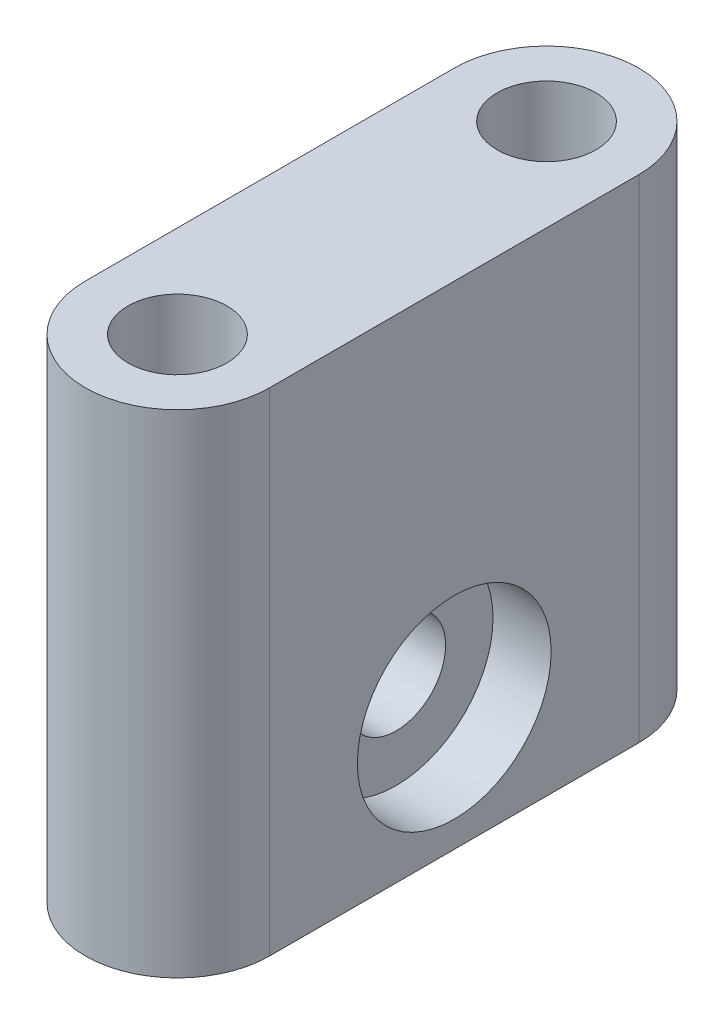
ISO-10303-21;
HEADER;
FILE_DESCRIPTION(('STEP AP214'),'2;1');
FILE_NAME('part.step','',(''),(''),'','','');
FILE_SCHEMA(('AUTOMOTIVE_DESIGN { 1 0 10303 214 1 1 1 1 }'));
ENDSEC;
DATA;
#1=APPLICATION_CONTEXT('core data for automotive mechanical design processes');
#2=APPLICATION_PROTOCOL_DEFINITION('international standard','automotive_design',2000,#1);
#3=PRODUCT_CONTEXT('',#1,'mechanical');
#4=PRODUCT('Part','Part','',(#3));
#5=PRODUCT_RELATED_PRODUCT_CATEGORY('part','',(#4));
#6=PRODUCT_DEFINITION_FORMATION('','',#4);
#7=PRODUCT_DEFINITION_CONTEXT('part definition',#1,'design');
#8=PRODUCT_DEFINITION('design','',#6,#7);
#9=PRODUCT_DEFINITION_SHAPE('','',#8);
#10=(LENGTH_UNIT() NAMED_UNIT(*) SI_UNIT(.MILLI.,.METRE.));
#11=(NAMED_UNIT(*) PLANE_ANGLE_UNIT() SI_UNIT($,.RADIAN.));
#12=(NAMED_UNIT(*) SI_UNIT($,.STERADIAN.) SOLID_ANGLE_UNIT());
#13=UNCERTAINTY_MEASURE_WITH_UNIT(LENGTH_MEASURE(1.E-05),#10,'distance_accuracy_value','');
#14=(GEOMETRIC_REPRESENTATION_CONTEXT(3) GLOBAL_UNCERTAINTY_ASSIGNED_CONTEXT((#13)) GLOBAL_UNIT_ASSIGNED_CONTEXT((#10,
#11,#12)) REPRESENTATION_CONTEXT('',''));
#15=CARTESIAN_POINT('',(0.,0.,0.));
#16=DIRECTION('',(0.,0.,1.));
#17=DIRECTION('',(1.,0.,0.));
#18=AXIS2_PLACEMENT_3D('',#15,#16,#17);
#19=CARTESIAN_POINT('',(0.,25.4,0.));
#20=DIRECTION('',(0.,1.,0.));
#21=DIRECTION('',(0.,0.,1.));
#22=AXIS2_PLACEMENT_3D('',#19,#20,#21);
#23=PLANE('',#22);
#24=CARTESIAN_POINT('',(-23.8125,25.4,9.52499999999999));
#25=DIRECTION('',(0.,1.,0.));
#26=DIRECTION('',(0.,0.,1.));
#27=AXIS2_PLACEMENT_3D('',#24,#25,#26);
#28=CIRCLE('',#27,4.7625);
#29=CARTESIAN_POINT('',(-28.575,25.4,9.52499999999999));
#30=VERTEX_POINT('',#29);
#31=CARTESIAN_POINT('',(-19.05,25.4,9.525));
#32=VERTEX_POINT('',#31);
#33=EDGE_CURVE('E102',#30,#32,#28,.T.);
#34=ORIENTED_EDGE('',*,*,#33,.T.);
#35=DIRECTION('',(0.,0.,1.));
#36=VECTOR('',#35,1.);
#37=CARTESIAN_POINT('',(-19.05,25.4,0.));
#38=LINE('',#37,#36);
#39=CARTESIAN_POINT('',(-19.05,25.4,-9.525));
#40=VERTEX_POINT('',#39);
#41=EDGE_CURVE('E112',#40,#32,#38,.T.);
#42=ORIENTED_EDGE('',*,*,#41,.F.);
#43=CARTESIAN_POINT('',(-23.8125,25.4,-9.52499999999999));
#44=DIRECTION('',(0.,1.,0.));
#45=DIRECTION('',(0.,0.,1.));
#46=AXIS2_PLACEMENT_3D('',#43,#44,#45);
#47=CIRCLE('',#46,4.7625);
#48=CARTESIAN_POINT('',(-28.575,25.4,-9.52499999999999));
#49=VERTEX_POINT('',#48);
#50=EDGE_CURVE('E110',#49,#40,#47,.F.);
#51=ORIENTED_EDGE('',*,*,#50,.F.);
#52=DIRECTION('',(0.,0.,1.));
#53=VECTOR('',#52,1.);
#54=CARTESIAN_POINT('',(-28.575,25.4,0.));
#55=LINE('',#54,#53);
#56=EDGE_CURVE('E94',#49,#30,#55,.T.);
#57=ORIENTED_EDGE('',*,*,#56,.T.);
#58=EDGE_LOOP('',(#34,#42,#51,#57));
#59=FACE_BOUND('',#58,.T.);
#60=CARTESIAN_POINT('',(-23.8125,25.4,-9.52499999999999));
#61=DIRECTION('',(0.,1.,0.));
#62=DIRECTION('',(0.,0.,1.));
#63=AXIS2_PLACEMENT_3D('',#60,#61,#62);
#64=CIRCLE('',#63,2.55269999999999);
#65=CARTESIAN_POINT('',(-23.8125,25.4,-6.9723));
#66=VERTEX_POINT('',#65);
#67=EDGE_CURVE('E98',#66,#66,#64,.T.);
#68=ORIENTED_EDGE('',*,*,#67,.F.);
#69=EDGE_LOOP('',(#68));
#70=FACE_BOUND('',#69,.T.);
#71=CARTESIAN_POINT('',(-23.8125,25.4,9.52499999999999));
#72=DIRECTION('',(0.,1.,0.));
#73=DIRECTION('',(0.,0.,1.));
#74=AXIS2_PLACEMENT_3D('',#71,#72,#73);
#75=CIRCLE('',#74,2.55269999999999);
#76=CARTESIAN_POINT('',(-23.8125,25.4,12.0777));
#77=VERTEX_POINT('',#76);
#78=EDGE_CURVE('E50',#77,#77,#75,.T.);
#79=ORIENTED_EDGE('',*,*,#78,.F.);
#80=EDGE_LOOP('',(#79));
#81=FACE_BOUND('',#80,.T.);
#82=ADVANCED_FACE('F41',(#59,#70,#81),#23,.T.);
#83=CARTESIAN_POINT('',(-23.8125,8.89,9.52499999999999));
#84=DIRECTION('',(0.,1.,0.));
#85=DIRECTION('',(0.,0.,1.));
#86=AXIS2_PLACEMENT_3D('',#83,#84,#85);
#87=CONICAL_SURFACE('',#86,2.55269999999998,1.02974425867665);
#88=CARTESIAN_POINT('',(-23.8125,7.35618309780835,9.52499999999999));
#89=VERTEX_POINT('',#88);
#90=VERTEX_LOOP('',#89);
#91=FACE_BOUND('',#90,.T.);
#92=CARTESIAN_POINT('',(-23.8125,8.89,9.52499999999999));
#93=DIRECTION('',(0.,1.,0.));
#94=DIRECTION('',(0.,0.,1.));
#95=AXIS2_PLACEMENT_3D('',#92,#93,#94);
#96=CIRCLE('',#95,2.55269999999998);
#97=CARTESIAN_POINT('',(-23.8125,8.89,12.0777));
#98=VERTEX_POINT('',#97);
#99=EDGE_CURVE('E11',#98,#98,#96,.T.);
#100=ORIENTED_EDGE('',*,*,#99,.T.);
#101=EDGE_LOOP('',(#100));
#102=FACE_BOUND('',#101,.T.);
#103=ADVANCED_FACE('F139',(#91,#102),#87,.F.);
#104=CARTESIAN_POINT('',(-23.8125,25.4,9.52499999999999));
#105=DIRECTION('',(0.,1.,0.));
#106=DIRECTION('',(0.,0.,1.));
#107=AXIS2_PLACEMENT_3D('',#104,#105,#106);
#108=CYLINDRICAL_SURFACE('',#107,2.55269999999999);
#109=ORIENTED_EDGE('',*,*,#99,.F.);
#110=EDGE_LOOP('',(#109));
#111=FACE_BOUND('',#110,.T.);
#112=ORIENTED_EDGE('',*,*,#78,.T.);
#113=EDGE_LOOP('',(#112));
#114=FACE_BOUND('',#113,.T.);
#115=ADVANCED_FACE('F136',(#111,#114),#108,.F.);
#116=CARTESIAN_POINT('',(-23.8125,8.89,-9.52499999999999));
#117=DIRECTION('',(0.,1.,0.));
#118=DIRECTION('',(0.,0.,1.));
#119=AXIS2_PLACEMENT_3D('',#116,#117,#118);
#120=CONICAL_SURFACE('',#119,2.55269999999998,1.02974425867665);
#121=CARTESIAN_POINT('',(-23.8125,7.35618309780835,-9.52499999999999));
#122=VERTEX_POINT('',#121);
#123=VERTEX_LOOP('',#122);
#124=FACE_BOUND('',#123,.T.);
#125=CARTESIAN_POINT('',(-23.8125,8.89,-9.52499999999999));
#126=DIRECTION('',(0.,1.,0.));
#127=DIRECTION('',(0.,0.,1.));
#128=AXIS2_PLACEMENT_3D('',#125,#126,#127);
#129=CIRCLE('',#128,2.55269999999998);
#130=CARTESIAN_POINT('',(-23.8125,8.89,-6.97230000000001));
#131=VERTEX_POINT('',#130);
#132=EDGE_CURVE('E130',#131,#131,#129,.T.);
#133=ORIENTED_EDGE('',*,*,#132,.T.);
#134=EDGE_LOOP('',(#133));
#135=FACE_BOUND('',#134,.T.);
#136=ADVANCED_FACE('F148',(#124,#135),#120,.F.);
#137=CARTESIAN_POINT('',(-23.8125,25.4,-9.52499999999999));
#138=DIRECTION('',(0.,1.,0.));
#139=DIRECTION('',(0.,0.,1.));
#140=AXIS2_PLACEMENT_3D('',#137,#138,#139);
#141=CYLINDRICAL_SURFACE('',#140,2.55269999999999);
#142=ORIENTED_EDGE('',*,*,#132,.F.);
#143=EDGE_LOOP('',(#142));
#144=FACE_BOUND('',#143,.T.);
#145=ORIENTED_EDGE('',*,*,#67,.T.);
#146=EDGE_LOOP('',(#145));
#147=FACE_BOUND('',#146,.T.);
#148=ADVANCED_FACE('F152',(#144,#147),#141,.F.);
#149=CARTESIAN_POINT('',(-23.8125,25.4,9.52499999999999));
#150=DIRECTION('',(0.,-1.,0.));
#151=DIRECTION('',(0.,0.,-1.));
#152=AXIS2_PLACEMENT_3D('',#149,#150,#151);
#153=CYLINDRICAL_SURFACE('',#152,4.7625);
#154=CARTESIAN_POINT('',(-23.8125,0.,9.52499999999999));
#155=DIRECTION('',(0.,1.,0.));
#156=DIRECTION('',(0.,0.,1.));
#157=AXIS2_PLACEMENT_3D('',#154,#155,#156);
#158=CIRCLE('',#157,4.7625);
#159=CARTESIAN_POINT('',(-28.575,0.,9.52499999999999));
#160=VERTEX_POINT('',#159);
#161=CARTESIAN_POINT('',(-19.05,0.,9.525));
#162=VERTEX_POINT('',#161);
#163=EDGE_CURVE('E65',#160,#162,#158,.T.);
#164=ORIENTED_EDGE('',*,*,#163,.T.);
#165=DIRECTION('',(0.,-1.,0.));
#166=VECTOR('',#165,1.);
#167=CARTESIAN_POINT('',(-19.05,25.4,9.525));
#168=LINE('',#167,#166);
#169=EDGE_CURVE('E104',#32,#162,#168,.T.);
#170=ORIENTED_EDGE('',*,*,#169,.F.);
#171=ORIENTED_EDGE('',*,*,#33,.F.);
#172=DIRECTION('',(0.,-1.,0.));
#173=VECTOR('',#172,1.);
#174=CARTESIAN_POINT('',(-28.575,25.4,9.52499999999999));
#175=LINE('',#174,#173);
#176=EDGE_CURVE('E90',#30,#160,#175,.T.);
#177=ORIENTED_EDGE('',*,*,#176,.T.);
#178=EDGE_LOOP('',(#164,#170,#171,#177));
#179=FACE_BOUND('',#178,.T.);
#180=ADVANCED_FACE('F103',(#179),#153,.T.);
#181=CARTESIAN_POINT('',(-28.575,25.4,0.));
#182=DIRECTION('',(1.,0.,0.));
#183=DIRECTION('',(0.,0.,-1.));
#184=AXIS2_PLACEMENT_3D('',#181,#182,#183);
#185=PLANE('',#184);
#186=CARTESIAN_POINT('',(-28.575,6.35,0.));
#187=DIRECTION('',(1.,0.,0.));
#188=DIRECTION('',(0.,0.,-1.));
#189=AXIS2_PLACEMENT_3D('',#186,#187,#188);
#190=CIRCLE('',#189,2.55269999999999);
#191=CARTESIAN_POINT('',(-28.575,6.35,-2.55269999999999));
#192=VERTEX_POINT('',#191);
#193=EDGE_CURVE('E188',#192,#192,#190,.T.);
#194=ORIENTED_EDGE('',*,*,#193,.T.);
#195=EDGE_LOOP('',(#194));
#196=FACE_BOUND('',#195,.T.);
#197=DIRECTION('',(0.,0.,1.));
#198=VECTOR('',#197,1.);
#199=CARTESIAN_POINT('',(-28.575,0.,0.));
#200=LINE('',#199,#198);
#201=CARTESIAN_POINT('',(-28.575,0.,-9.52499999999999));
#202=VERTEX_POINT('',#201);
#203=EDGE_CURVE('E97',#202,#160,#200,.T.);
#204=ORIENTED_EDGE('',*,*,#203,.T.);
#205=ORIENTED_EDGE('',*,*,#176,.F.);
#206=ORIENTED_EDGE('',*,*,#56,.F.);
#207=DIRECTION('',(0.,-1.,0.));
#208=VECTOR('',#207,1.);
#209=CARTESIAN_POINT('',(-28.575,25.4,-9.52499999999999));
#210=LINE('',#209,#208);
#211=EDGE_CURVE('E99',#49,#202,#210,.T.);
#212=ORIENTED_EDGE('',*,*,#211,.T.);
#213=EDGE_LOOP('',(#204,#205,#206,#212));
#214=FACE_BOUND('',#213,.T.);
#215=ADVANCED_FACE('F92',(#196,#214),#185,.F.);
#216=CARTESIAN_POINT('',(-23.8125,25.4,-9.52499999999999));
#217=DIRECTION('',(0.,-1.,0.));
#218=DIRECTION('',(0.,0.,-1.));
#219=AXIS2_PLACEMENT_3D('',#216,#217,#218);
#220=CYLINDRICAL_SURFACE('',#219,4.7625);
#221=CARTESIAN_POINT('',(-23.8125,0.,-9.52499999999999));
#222=DIRECTION('',(0.,1.,0.));
#223=DIRECTION('',(0.,0.,1.));
#224=AXIS2_PLACEMENT_3D('',#221,#222,#223);
#225=CIRCLE('',#224,4.7625);
#226=CARTESIAN_POINT('',(-19.05,0.,-9.525));
#227=VERTEX_POINT('',#226);
#228=EDGE_CURVE('E120',#202,#227,#225,.F.);
#229=ORIENTED_EDGE('',*,*,#228,.F.);
#230=ORIENTED_EDGE('',*,*,#211,.F.);
#231=ORIENTED_EDGE('',*,*,#50,.T.);
#232=DIRECTION('',(0.,-1.,0.));
#233=VECTOR('',#232,1.);
#234=CARTESIAN_POINT('',(-19.05,25.4,-9.525));
#235=LINE('',#234,#233);
#236=EDGE_CURVE('E57',#40,#227,#235,.T.);
#237=ORIENTED_EDGE('',*,*,#236,.T.);
#238=EDGE_LOOP('',(#229,#230,#231,#237));
#239=FACE_BOUND('',#238,.T.);
#240=ADVANCED_FACE('F161',(#239),#220,.T.);
#241=CARTESIAN_POINT('',(-19.05,25.4,0.));
#242=DIRECTION('',(1.,0.,0.));
#243=DIRECTION('',(0.,0.,-1.));
#244=AXIS2_PLACEMENT_3D('',#241,#242,#243);
#245=PLANE('',#244);
#246=CARTESIAN_POINT('',(-19.05,6.35,0.));
#247=DIRECTION('',(1.,0.,0.));
#248=DIRECTION('',(0.,0.,-1.));
#249=AXIS2_PLACEMENT_3D('',#246,#247,#248);
#250=CIRCLE('',#249,5.000000033);
#251=CARTESIAN_POINT('',(-19.05,6.35,-5.000000033));
#252=VERTEX_POINT('',#251);
#253=EDGE_CURVE('E189',#252,#252,#250,.T.);
#254=ORIENTED_EDGE('',*,*,#253,.F.);
#255=EDGE_LOOP('',(#254));
#256=FACE_BOUND('',#255,.T.);
#257=DIRECTION('',(0.,0.,1.));
#258=VECTOR('',#257,1.);
#259=CARTESIAN_POINT('',(-19.05,0.,0.));
#260=LINE('',#259,#258);
#261=EDGE_CURVE('E107',#227,#162,#260,.T.);
#262=ORIENTED_EDGE('',*,*,#261,.F.);
#263=ORIENTED_EDGE('',*,*,#236,.F.);
#264=ORIENTED_EDGE('',*,*,#41,.T.);
#265=ORIENTED_EDGE('',*,*,#169,.T.);
#266=EDGE_LOOP('',(#262,#263,#264,#265));
#267=FACE_BOUND('',#266,.T.);
#268=ADVANCED_FACE('F165',(#256,#267),#245,.T.);
#269=CARTESIAN_POINT('',(0.,0.,0.));
#270=DIRECTION('',(0.,1.,0.));
#271=DIRECTION('',(0.,0.,1.));
#272=AXIS2_PLACEMENT_3D('',#269,#270,#271);
#273=PLANE('',#272);
#274=ORIENTED_EDGE('',*,*,#261,.T.);
#275=ORIENTED_EDGE('',*,*,#163,.F.);
#276=ORIENTED_EDGE('',*,*,#203,.F.);
#277=ORIENTED_EDGE('',*,*,#228,.T.);
#278=EDGE_LOOP('',(#274,#275,#276,#277));
#279=FACE_BOUND('',#278,.T.);
#280=ADVANCED_FACE('F43',(#279),#273,.F.);
#281=CARTESIAN_POINT('',(-22.05,6.35,0.));
#282=DIRECTION('',(1.,0.,0.));
#283=DIRECTION('',(0.,0.,-1.));
#284=AXIS2_PLACEMENT_3D('',#281,#282,#283);
#285=CYLINDRICAL_SURFACE('',#284,5.000000033);
#286=CARTESIAN_POINT('',(-22.05,6.35,0.));
#287=DIRECTION('',(1.,0.,0.));
#288=DIRECTION('',(0.,0.,-1.));
#289=AXIS2_PLACEMENT_3D('',#286,#287,#288);
#290=CIRCLE('',#289,5.000000033);
#291=CARTESIAN_POINT('',(-22.05,6.35,-5.000000033));
#292=VERTEX_POINT('',#291);
#293=EDGE_CURVE('E118',#292,#292,#290,.T.);
#294=ORIENTED_EDGE('',*,*,#293,.F.);
#295=EDGE_LOOP('',(#294));
#296=FACE_BOUND('',#295,.T.);
#297=ORIENTED_EDGE('',*,*,#253,.T.);
#298=EDGE_LOOP('',(#297));
#299=FACE_BOUND('',#298,.T.);
#300=ADVANCED_FACE('F170',(#296,#299),#285,.F.);
#301=CARTESIAN_POINT('',(-22.05,6.35,0.));
#302=DIRECTION('',(1.,0.,0.));
#303=DIRECTION('',(0.,0.,-1.));
#304=AXIS2_PLACEMENT_3D('',#301,#302,#303);
#305=PLANE('',#304);
#306=CARTESIAN_POINT('',(-22.05,6.35,0.));
#307=DIRECTION('',(1.,0.,0.));
#308=DIRECTION('',(0.,0.,-1.));
#309=AXIS2_PLACEMENT_3D('',#306,#307,#308);
#310=CIRCLE('',#309,2.55269999999999);
#311=CARTESIAN_POINT('',(-22.05,6.35,-2.55269999999999));
#312=VERTEX_POINT('',#311);
#313=EDGE_CURVE('E45',#312,#312,#310,.T.);
#314=ORIENTED_EDGE('',*,*,#313,.F.);
#315=EDGE_LOOP('',(#314));
#316=FACE_BOUND('',#315,.T.);
#317=ORIENTED_EDGE('',*,*,#293,.T.);
#318=EDGE_LOOP('',(#317));
#319=FACE_BOUND('',#318,.T.);
#320=ADVANCED_FACE('F173',(#316,#319),#305,.T.);
#321=CARTESIAN_POINT('',(-19.05,6.35,0.));
#322=DIRECTION('',(1.,0.,0.));
#323=DIRECTION('',(0.,0.,-1.));
#324=AXIS2_PLACEMENT_3D('',#321,#322,#323);
#325=CYLINDRICAL_SURFACE('',#324,2.55269999999999);
#326=ORIENTED_EDGE('',*,*,#313,.T.);
#327=EDGE_LOOP('',(#326));
#328=FACE_BOUND('',#327,.T.);
#329=ORIENTED_EDGE('',*,*,#193,.F.);
#330=EDGE_LOOP('',(#329));
#331=FACE_BOUND('',#330,.T.);
#332=ADVANCED_FACE('F177',(#328,#331),#325,.F.);
#333=CLOSED_SHELL('',(#82,#103,#115,#136,#148,#180,#215,#240,#268,#280,#300,#320,#332));
#334=MANIFOLD_SOLID_BREP('B2',#333);
#335=ADVANCED_BREP_SHAPE_REPRESENTATION('',(#18,#334),#14);
#336=SHAPE_DEFINITION_REPRESENTATION(#9,#335);
ENDSEC;
END-ISO-10303-21;
